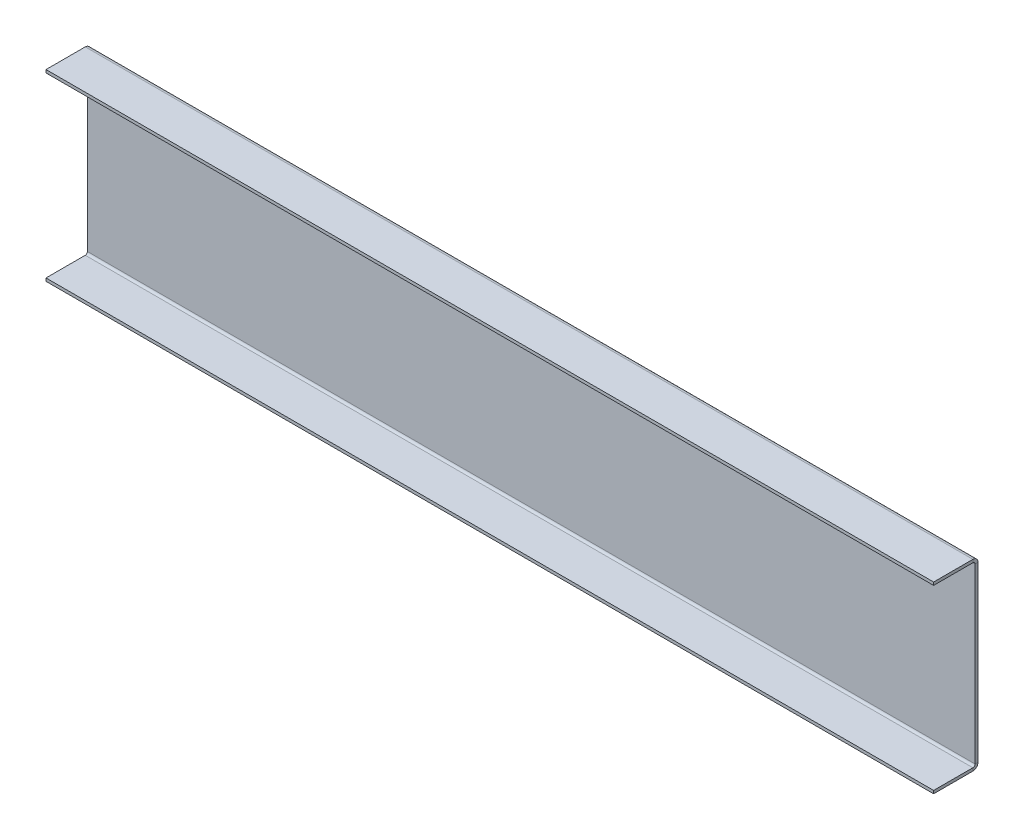
ISO-10303-21;
HEADER;
FILE_DESCRIPTION(('STEP AP214'),'2;1');
FILE_NAME('part.step','',(''),(''),'','','');
FILE_SCHEMA(('AUTOMOTIVE_DESIGN { 1 0 10303 214 1 1 1 1 }'));
ENDSEC;
DATA;
#1=APPLICATION_CONTEXT('core data for automotive mechanical design processes');
#2=APPLICATION_PROTOCOL_DEFINITION('international standard','automotive_design',2000,#1);
#3=PRODUCT_CONTEXT('',#1,'mechanical');
#4=PRODUCT('Part','Part','',(#3));
#5=PRODUCT_RELATED_PRODUCT_CATEGORY('part','',(#4));
#6=PRODUCT_DEFINITION_FORMATION('','',#4);
#7=PRODUCT_DEFINITION_CONTEXT('part definition',#1,'design');
#8=PRODUCT_DEFINITION('design','',#6,#7);
#9=PRODUCT_DEFINITION_SHAPE('','',#8);
#10=(LENGTH_UNIT() NAMED_UNIT(*) SI_UNIT(.MILLI.,.METRE.));
#11=(NAMED_UNIT(*) PLANE_ANGLE_UNIT() SI_UNIT($,.RADIAN.));
#12=(NAMED_UNIT(*) SI_UNIT($,.STERADIAN.) SOLID_ANGLE_UNIT());
#13=UNCERTAINTY_MEASURE_WITH_UNIT(LENGTH_MEASURE(1.E-05),#10,'distance_accuracy_value','');
#14=(GEOMETRIC_REPRESENTATION_CONTEXT(3) GLOBAL_UNCERTAINTY_ASSIGNED_CONTEXT((#13)) GLOBAL_UNIT_ASSIGNED_CONTEXT((#10,
#11,#12)) REPRESENTATION_CONTEXT('',''));
#15=CARTESIAN_POINT('',(0.,0.,0.));
#16=DIRECTION('',(0.,0.,1.));
#17=DIRECTION('',(1.,0.,0.));
#18=AXIS2_PLACEMENT_3D('',#15,#16,#17);
#19=CARTESIAN_POINT('',(0.,0.,-1.));
#20=DIRECTION('',(0.,0.,1.));
#21=DIRECTION('',(1.,0.,0.));
#22=AXIS2_PLACEMENT_3D('',#19,#20,#21);
#23=PLANE('',#22);
#24=DIRECTION('',(1.,0.,0.));
#25=VECTOR('',#24,1.);
#26=CARTESIAN_POINT('',(150.,-29.2634,-1.));
#27=LINE('',#26,#25);
#28=CARTESIAN_POINT('',(150.,-29.2634,-1.));
#29=VERTEX_POINT('',#28);
#30=CARTESIAN_POINT('',(-150.,-29.2634,-1.));
#31=VERTEX_POINT('',#30);
#32=EDGE_CURVE('E138',#29,#31,#27,.F.);
#33=ORIENTED_EDGE('',*,*,#32,.T.);
#34=DIRECTION('',(0.,-1.,0.));
#35=VECTOR('',#34,1.);
#36=CARTESIAN_POINT('',(-150.,30.,-1.));
#37=LINE('',#36,#35);
#38=CARTESIAN_POINT('',(-150.,29.2634,-0.999999999999997));
#39=VERTEX_POINT('',#38);
#40=EDGE_CURVE('E11',#39,#31,#37,.T.);
#41=ORIENTED_EDGE('',*,*,#40,.F.);
#42=DIRECTION('',(-1.,0.,0.));
#43=VECTOR('',#42,1.);
#44=CARTESIAN_POINT('',(-150.,29.2634,-0.999999999999997));
#45=LINE('',#44,#43);
#46=CARTESIAN_POINT('',(150.,29.2634,-1.));
#47=VERTEX_POINT('',#46);
#48=EDGE_CURVE('E227',#39,#47,#45,.F.);
#49=ORIENTED_EDGE('',*,*,#48,.T.);
#50=DIRECTION('',(0.,1.,0.));
#51=VECTOR('',#50,1.);
#52=CARTESIAN_POINT('',(150.,30.,-1.));
#53=LINE('',#52,#51);
#54=EDGE_CURVE('E48',#29,#47,#53,.T.);
#55=ORIENTED_EDGE('',*,*,#54,.F.);
#56=EDGE_LOOP('',(#33,#41,#49,#55));
#57=FACE_BOUND('',#56,.T.);
#58=ADVANCED_FACE('F39',(#57),#23,.F.);
#59=CARTESIAN_POINT('',(0.,0.,0.));
#60=DIRECTION('',(0.,0.,1.));
#61=DIRECTION('',(1.,0.,0.));
#62=AXIS2_PLACEMENT_3D('',#59,#60,#61);
#63=PLANE('',#62);
#64=DIRECTION('',(0.,-1.,0.));
#65=VECTOR('',#64,1.);
#66=CARTESIAN_POINT('',(-150.,30.,0.));
#67=LINE('',#66,#65);
#68=CARTESIAN_POINT('',(-150.,29.2634,0.));
#69=VERTEX_POINT('',#68);
#70=CARTESIAN_POINT('',(-150.,-29.2634,0.));
#71=VERTEX_POINT('',#70);
#72=EDGE_CURVE('E43',#69,#71,#67,.T.);
#73=ORIENTED_EDGE('',*,*,#72,.T.);
#74=DIRECTION('',(1.,0.,0.));
#75=VECTOR('',#74,1.);
#76=CARTESIAN_POINT('',(150.,-29.2634,0.));
#77=LINE('',#76,#75);
#78=CARTESIAN_POINT('',(150.,-29.2634,0.));
#79=VERTEX_POINT('',#78);
#80=EDGE_CURVE('E188',#79,#71,#77,.F.);
#81=ORIENTED_EDGE('',*,*,#80,.F.);
#82=DIRECTION('',(0.,1.,0.));
#83=VECTOR('',#82,1.);
#84=CARTESIAN_POINT('',(150.,30.,0.));
#85=LINE('',#84,#83);
#86=CARTESIAN_POINT('',(150.,29.2634,0.));
#87=VERTEX_POINT('',#86);
#88=EDGE_CURVE('E245',#79,#87,#85,.T.);
#89=ORIENTED_EDGE('',*,*,#88,.T.);
#90=DIRECTION('',(-1.,0.,0.));
#91=VECTOR('',#90,1.);
#92=CARTESIAN_POINT('',(-150.,29.2634,0.));
#93=LINE('',#92,#91);
#94=EDGE_CURVE('E56',#69,#87,#93,.F.);
#95=ORIENTED_EDGE('',*,*,#94,.F.);
#96=EDGE_LOOP('',(#73,#81,#89,#95));
#97=FACE_BOUND('',#96,.T.);
#98=ADVANCED_FACE('F249',(#97),#63,.T.);
#99=CARTESIAN_POINT('',(150.,30.,-1.));
#100=DIRECTION('',(1.,0.,0.));
#101=DIRECTION('',(0.,0.,-1.));
#102=AXIS2_PLACEMENT_3D('',#99,#100,#101);
#103=PLANE('',#102);
#104=ORIENTED_EDGE('',*,*,#88,.F.);
#105=DIRECTION('',(0.,0.,-1.));
#106=VECTOR('',#105,1.);
#107=CARTESIAN_POINT('',(150.,-29.2634,0.));
#108=LINE('',#107,#106);
#109=EDGE_CURVE('E184',#79,#29,#108,.T.);
#110=ORIENTED_EDGE('',*,*,#109,.T.);
#111=ORIENTED_EDGE('',*,*,#54,.T.);
#112=DIRECTION('',(0.,0.,-1.));
#113=VECTOR('',#112,1.);
#114=CARTESIAN_POINT('',(150.,29.2634,0.));
#115=LINE('',#114,#113);
#116=EDGE_CURVE('E242',#87,#47,#115,.T.);
#117=ORIENTED_EDGE('',*,*,#116,.F.);
#118=EDGE_LOOP('',(#104,#110,#111,#117));
#119=FACE_BOUND('',#118,.T.);
#120=ADVANCED_FACE('F41',(#119),#103,.T.);
#121=CARTESIAN_POINT('',(-150.,30.,-1.));
#122=DIRECTION('',(-1.,0.,0.));
#123=DIRECTION('',(0.,0.,1.));
#124=AXIS2_PLACEMENT_3D('',#121,#122,#123);
#125=PLANE('',#124);
#126=DIRECTION('',(0.,0.,-1.));
#127=VECTOR('',#126,1.);
#128=CARTESIAN_POINT('',(-150.,-29.2634,0.));
#129=LINE('',#128,#127);
#130=EDGE_CURVE('E192',#71,#31,#129,.T.);
#131=ORIENTED_EDGE('',*,*,#130,.F.);
#132=ORIENTED_EDGE('',*,*,#72,.F.);
#133=DIRECTION('',(0.,0.,-1.));
#134=VECTOR('',#133,1.);
#135=CARTESIAN_POINT('',(-150.,29.2634,0.));
#136=LINE('',#135,#134);
#137=EDGE_CURVE('E233',#69,#39,#136,.T.);
#138=ORIENTED_EDGE('',*,*,#137,.T.);
#139=ORIENTED_EDGE('',*,*,#40,.T.);
#140=EDGE_LOOP('',(#131,#132,#138,#139));
#141=FACE_BOUND('',#140,.T.);
#142=ADVANCED_FACE('F288',(#141),#125,.T.);
#143=CARTESIAN_POINT('',(150.,29.2634,0.736600000000003));
#144=DIRECTION('',(1.,0.,0.));
#145=DIRECTION('',(0.,0.,-1.));
#146=AXIS2_PLACEMENT_3D('',#143,#144,#145);
#147=PLANE('',#146);
#148=DIRECTION('',(0.,1.,0.));
#149=VECTOR('',#148,1.);
#150=CARTESIAN_POINT('',(150.,30.,0.736599999999997));
#151=LINE('',#150,#149);
#152=CARTESIAN_POINT('',(150.,30.,0.7366));
#153=VERTEX_POINT('',#152);
#154=CARTESIAN_POINT('',(150.,31.,0.736599999999997));
#155=VERTEX_POINT('',#154);
#156=EDGE_CURVE('E195',#153,#155,#151,.T.);
#157=ORIENTED_EDGE('',*,*,#156,.F.);
#158=CARTESIAN_POINT('',(150.,29.2634,0.736600000000003));
#159=DIRECTION('',(-1.,0.,0.));
#160=DIRECTION('',(0.,0.,1.));
#161=AXIS2_PLACEMENT_3D('',#158,#159,#160);
#162=CIRCLE('',#161,0.7366);
#163=EDGE_CURVE('E236',#87,#153,#162,.F.);
#164=ORIENTED_EDGE('',*,*,#163,.F.);
#165=ORIENTED_EDGE('',*,*,#116,.T.);
#166=CARTESIAN_POINT('',(150.,29.2634,0.736600000000003));
#167=DIRECTION('',(-1.,0.,0.));
#168=DIRECTION('',(0.,0.,1.));
#169=AXIS2_PLACEMENT_3D('',#166,#167,#168);
#170=CIRCLE('',#169,1.7366);
#171=EDGE_CURVE('E229',#47,#155,#170,.F.);
#172=ORIENTED_EDGE('',*,*,#171,.T.);
#173=EDGE_LOOP('',(#157,#164,#165,#172));
#174=FACE_BOUND('',#173,.T.);
#175=ADVANCED_FACE('F290',(#174),#147,.T.);
#176=CARTESIAN_POINT('',(-150.,29.2634,0.736600000000003));
#177=DIRECTION('',(1.,0.,0.));
#178=DIRECTION('',(0.,0.,-1.));
#179=AXIS2_PLACEMENT_3D('',#176,#177,#178);
#180=PLANE('',#179);
#181=CARTESIAN_POINT('',(-150.,29.2634,0.736600000000003));
#182=DIRECTION('',(-1.,0.,0.));
#183=DIRECTION('',(0.,0.,1.));
#184=AXIS2_PLACEMENT_3D('',#181,#182,#183);
#185=CIRCLE('',#184,0.7366);
#186=CARTESIAN_POINT('',(-150.,30.,0.7366));
#187=VERTEX_POINT('',#186);
#188=EDGE_CURVE('E226',#187,#69,#185,.T.);
#189=ORIENTED_EDGE('',*,*,#188,.F.);
#190=DIRECTION('',(0.,1.,0.));
#191=VECTOR('',#190,1.);
#192=CARTESIAN_POINT('',(-150.,30.,0.736600000000004));
#193=LINE('',#192,#191);
#194=CARTESIAN_POINT('',(-150.,31.,0.7366));
#195=VERTEX_POINT('',#194);
#196=EDGE_CURVE('E199',#187,#195,#193,.T.);
#197=ORIENTED_EDGE('',*,*,#196,.T.);
#198=CARTESIAN_POINT('',(-150.,29.2634,0.736600000000003));
#199=DIRECTION('',(-1.,0.,0.));
#200=DIRECTION('',(0.,0.,1.));
#201=AXIS2_PLACEMENT_3D('',#198,#199,#200);
#202=CIRCLE('',#201,1.7366);
#203=EDGE_CURVE('E230',#195,#39,#202,.T.);
#204=ORIENTED_EDGE('',*,*,#203,.T.);
#205=ORIENTED_EDGE('',*,*,#137,.F.);
#206=EDGE_LOOP('',(#189,#197,#204,#205));
#207=FACE_BOUND('',#206,.T.);
#208=ADVANCED_FACE('F286',(#207),#180,.F.);
#209=CARTESIAN_POINT('',(-150.,29.2634,0.736600000000003));
#210=DIRECTION('',(-1.,0.,0.));
#211=DIRECTION('',(0.,1.,0.));
#212=AXIS2_PLACEMENT_3D('',#209,#210,#211);
#213=CYLINDRICAL_SURFACE('',#212,1.7366);
#214=ORIENTED_EDGE('',*,*,#48,.F.);
#215=ORIENTED_EDGE('',*,*,#203,.F.);
#216=DIRECTION('',(1.,0.,0.));
#217=VECTOR('',#216,1.);
#218=CARTESIAN_POINT('',(0.,31.,0.736599999999997));
#219=LINE('',#218,#217);
#220=EDGE_CURVE('E202',#195,#155,#219,.T.);
#221=ORIENTED_EDGE('',*,*,#220,.T.);
#222=ORIENTED_EDGE('',*,*,#171,.F.);
#223=EDGE_LOOP('',(#214,#215,#221,#222));
#224=FACE_BOUND('',#223,.T.);
#225=ADVANCED_FACE('F335',(#224),#213,.T.);
#226=CARTESIAN_POINT('',(-150.,29.2634,0.736600000000003));
#227=DIRECTION('',(-1.,0.,0.));
#228=DIRECTION('',(0.,1.,0.));
#229=AXIS2_PLACEMENT_3D('',#226,#227,#228);
#230=CYLINDRICAL_SURFACE('',#229,0.7366);
#231=ORIENTED_EDGE('',*,*,#94,.T.);
#232=ORIENTED_EDGE('',*,*,#163,.T.);
#233=DIRECTION('',(-1.,0.,0.));
#234=VECTOR('',#233,1.);
#235=CARTESIAN_POINT('',(150.,30.,0.736599999999997));
#236=LINE('',#235,#234);
#237=EDGE_CURVE('E197',#153,#187,#236,.T.);
#238=ORIENTED_EDGE('',*,*,#237,.T.);
#239=ORIENTED_EDGE('',*,*,#188,.T.);
#240=EDGE_LOOP('',(#231,#232,#238,#239));
#241=FACE_BOUND('',#240,.T.);
#242=ADVANCED_FACE('F300',(#241),#230,.F.);
#243=CARTESIAN_POINT('',(150.,31.,0.));
#244=DIRECTION('',(-1.,0.,0.));
#245=DIRECTION('',(0.,0.,1.));
#246=AXIS2_PLACEMENT_3D('',#243,#244,#245);
#247=PLANE('',#246);
#248=ORIENTED_EDGE('',*,*,#156,.T.);
#249=DIRECTION('',(0.,0.,-1.));
#250=VECTOR('',#249,1.);
#251=CARTESIAN_POINT('',(150.,31.,0.));
#252=LINE('',#251,#250);
#253=CARTESIAN_POINT('',(150.,31.,14.));
#254=VERTEX_POINT('',#253);
#255=EDGE_CURVE('E207',#254,#155,#252,.T.);
#256=ORIENTED_EDGE('',*,*,#255,.F.);
#257=DIRECTION('',(0.,-1.,0.));
#258=VECTOR('',#257,1.);
#259=CARTESIAN_POINT('',(150.,31.,14.));
#260=LINE('',#259,#258);
#261=CARTESIAN_POINT('',(150.,30.,14.));
#262=VERTEX_POINT('',#261);
#263=EDGE_CURVE('E215',#254,#262,#260,.T.);
#264=ORIENTED_EDGE('',*,*,#263,.T.);
#265=DIRECTION('',(0.,0.,-1.));
#266=VECTOR('',#265,1.);
#267=CARTESIAN_POINT('',(150.,30.,0.));
#268=LINE('',#267,#266);
#269=EDGE_CURVE('E206',#262,#153,#268,.T.);
#270=ORIENTED_EDGE('',*,*,#269,.T.);
#271=EDGE_LOOP('',(#248,#256,#264,#270));
#272=FACE_BOUND('',#271,.T.);
#273=ADVANCED_FACE('F305',(#272),#247,.F.);
#274=CARTESIAN_POINT('',(-150.,31.,14.));
#275=DIRECTION('',(1.,0.,0.));
#276=DIRECTION('',(0.,0.,-1.));
#277=AXIS2_PLACEMENT_3D('',#274,#275,#276);
#278=PLANE('',#277);
#279=ORIENTED_EDGE('',*,*,#196,.F.);
#280=DIRECTION('',(0.,0.,1.));
#281=VECTOR('',#280,1.);
#282=CARTESIAN_POINT('',(-150.,30.,14.));
#283=LINE('',#282,#281);
#284=CARTESIAN_POINT('',(-150.,30.,14.));
#285=VERTEX_POINT('',#284);
#286=EDGE_CURVE('E218',#187,#285,#283,.T.);
#287=ORIENTED_EDGE('',*,*,#286,.T.);
#288=DIRECTION('',(0.,-1.,0.));
#289=VECTOR('',#288,1.);
#290=CARTESIAN_POINT('',(-150.,31.,14.));
#291=LINE('',#290,#289);
#292=CARTESIAN_POINT('',(-150.,31.,14.));
#293=VERTEX_POINT('',#292);
#294=EDGE_CURVE('E223',#293,#285,#291,.T.);
#295=ORIENTED_EDGE('',*,*,#294,.F.);
#296=DIRECTION('',(0.,0.,1.));
#297=VECTOR('',#296,1.);
#298=CARTESIAN_POINT('',(-150.,31.,14.));
#299=LINE('',#298,#297);
#300=EDGE_CURVE('E210',#195,#293,#299,.T.);
#301=ORIENTED_EDGE('',*,*,#300,.F.);
#302=EDGE_LOOP('',(#279,#287,#295,#301));
#303=FACE_BOUND('',#302,.T.);
#304=ADVANCED_FACE('F323',(#303),#278,.F.);
#305=CARTESIAN_POINT('',(0.,31.,-1.07574889897452E-13));
#306=DIRECTION('',(0.,-1.,0.));
#307=DIRECTION('',(0.,0.,-1.));
#308=AXIS2_PLACEMENT_3D('',#305,#306,#307);
#309=PLANE('',#308);
#310=ORIENTED_EDGE('',*,*,#220,.F.);
#311=ORIENTED_EDGE('',*,*,#300,.T.);
#312=DIRECTION('',(1.,0.,0.));
#313=VECTOR('',#312,1.);
#314=CARTESIAN_POINT('',(150.,31.,14.));
#315=LINE('',#314,#313);
#316=EDGE_CURVE('E213',#293,#254,#315,.T.);
#317=ORIENTED_EDGE('',*,*,#316,.T.);
#318=ORIENTED_EDGE('',*,*,#255,.T.);
#319=EDGE_LOOP('',(#310,#311,#317,#318));
#320=FACE_BOUND('',#319,.T.);
#321=ADVANCED_FACE('F309',(#320),#309,.F.);
#322=CARTESIAN_POINT('',(0.,30.,-1.04083408558608E-13));
#323=DIRECTION('',(0.,-1.,0.));
#324=DIRECTION('',(0.,0.,-1.));
#325=AXIS2_PLACEMENT_3D('',#322,#323,#324);
#326=PLANE('',#325);
#327=ORIENTED_EDGE('',*,*,#286,.F.);
#328=ORIENTED_EDGE('',*,*,#237,.F.);
#329=ORIENTED_EDGE('',*,*,#269,.F.);
#330=DIRECTION('',(1.,0.,0.));
#331=VECTOR('',#330,1.);
#332=CARTESIAN_POINT('',(150.,30.,14.));
#333=LINE('',#332,#331);
#334=EDGE_CURVE('E211',#285,#262,#333,.T.);
#335=ORIENTED_EDGE('',*,*,#334,.F.);
#336=EDGE_LOOP('',(#327,#328,#329,#335));
#337=FACE_BOUND('',#336,.T.);
#338=ADVANCED_FACE('F319',(#337),#326,.T.);
#339=CARTESIAN_POINT('',(150.,31.,14.));
#340=DIRECTION('',(0.,0.,-1.));
#341=DIRECTION('',(0.,1.,0.));
#342=AXIS2_PLACEMENT_3D('',#339,#340,#341);
#343=PLANE('',#342);
#344=ORIENTED_EDGE('',*,*,#334,.T.);
#345=ORIENTED_EDGE('',*,*,#263,.F.);
#346=ORIENTED_EDGE('',*,*,#316,.F.);
#347=ORIENTED_EDGE('',*,*,#294,.T.);
#348=EDGE_LOOP('',(#344,#345,#346,#347));
#349=FACE_BOUND('',#348,.T.);
#350=ADVANCED_FACE('F315',(#349),#343,.F.);
#351=CARTESIAN_POINT('',(-150.,-29.2634,0.736599999999998));
#352=DIRECTION('',(-1.,0.,0.));
#353=DIRECTION('',(0.,0.,1.));
#354=AXIS2_PLACEMENT_3D('',#351,#352,#353);
#355=PLANE('',#354);
#356=DIRECTION('',(0.,-1.,0.));
#357=VECTOR('',#356,1.);
#358=CARTESIAN_POINT('',(-150.,-30.,0.736599999999997));
#359=LINE('',#358,#357);
#360=CARTESIAN_POINT('',(-150.,-30.,0.736599999999995));
#361=VERTEX_POINT('',#360);
#362=CARTESIAN_POINT('',(-150.,-31.,0.736599999999992));
#363=VERTEX_POINT('',#362);
#364=EDGE_CURVE('E259',#361,#363,#359,.T.);
#365=ORIENTED_EDGE('',*,*,#364,.F.);
#366=CARTESIAN_POINT('',(-150.,-29.2634,0.736599999999998));
#367=DIRECTION('',(1.,0.,0.));
#368=DIRECTION('',(0.,0.,-1.));
#369=AXIS2_PLACEMENT_3D('',#366,#367,#368);
#370=CIRCLE('',#369,0.7366);
#371=EDGE_CURVE('E141',#71,#361,#370,.F.);
#372=ORIENTED_EDGE('',*,*,#371,.F.);
#373=ORIENTED_EDGE('',*,*,#130,.T.);
#374=CARTESIAN_POINT('',(-150.,-29.2634,0.736599999999998));
#375=DIRECTION('',(1.,0.,0.));
#376=DIRECTION('',(0.,0.,-1.));
#377=AXIS2_PLACEMENT_3D('',#374,#375,#376);
#378=CIRCLE('',#377,1.7366);
#379=EDGE_CURVE('E183',#31,#363,#378,.F.);
#380=ORIENTED_EDGE('',*,*,#379,.T.);
#381=EDGE_LOOP('',(#365,#372,#373,#380));
#382=FACE_BOUND('',#381,.T.);
#383=ADVANCED_FACE('F257',(#382),#355,.T.);
#384=CARTESIAN_POINT('',(150.,-29.2634,0.736599999999998));
#385=DIRECTION('',(-1.,0.,0.));
#386=DIRECTION('',(0.,0.,1.));
#387=AXIS2_PLACEMENT_3D('',#384,#385,#386);
#388=PLANE('',#387);
#389=CARTESIAN_POINT('',(150.,-29.2634,0.736599999999998));
#390=DIRECTION('',(1.,0.,0.));
#391=DIRECTION('',(0.,0.,-1.));
#392=AXIS2_PLACEMENT_3D('',#389,#390,#391);
#393=CIRCLE('',#392,0.7366);
#394=CARTESIAN_POINT('',(150.,-30.,0.736599999999995));
#395=VERTEX_POINT('',#394);
#396=EDGE_CURVE('E148',#395,#79,#393,.T.);
#397=ORIENTED_EDGE('',*,*,#396,.F.);
#398=DIRECTION('',(0.,-1.,0.));
#399=VECTOR('',#398,1.);
#400=CARTESIAN_POINT('',(150.,-30.,0.736599999999993));
#401=LINE('',#400,#399);
#402=CARTESIAN_POINT('',(150.,-31.,0.73659999999999));
#403=VERTEX_POINT('',#402);
#404=EDGE_CURVE('E145',#395,#403,#401,.T.);
#405=ORIENTED_EDGE('',*,*,#404,.T.);
#406=CARTESIAN_POINT('',(150.,-29.2634,0.736599999999998));
#407=DIRECTION('',(1.,0.,0.));
#408=DIRECTION('',(0.,0.,-1.));
#409=AXIS2_PLACEMENT_3D('',#406,#407,#408);
#410=CIRCLE('',#409,1.7366);
#411=EDGE_CURVE('E131',#403,#29,#410,.T.);
#412=ORIENTED_EDGE('',*,*,#411,.T.);
#413=ORIENTED_EDGE('',*,*,#109,.F.);
#414=EDGE_LOOP('',(#397,#405,#412,#413));
#415=FACE_BOUND('',#414,.T.);
#416=ADVANCED_FACE('F146',(#415),#388,.F.);
#417=CARTESIAN_POINT('',(150.,-29.2634,0.736599999999998));
#418=DIRECTION('',(1.,0.,0.));
#419=DIRECTION('',(0.,-1.,0.));
#420=AXIS2_PLACEMENT_3D('',#417,#418,#419);
#421=CYLINDRICAL_SURFACE('',#420,1.7366);
#422=ORIENTED_EDGE('',*,*,#32,.F.);
#423=ORIENTED_EDGE('',*,*,#411,.F.);
#424=DIRECTION('',(-1.,0.,0.));
#425=VECTOR('',#424,1.);
#426=CARTESIAN_POINT('',(0.,-31.,0.736599999999992));
#427=LINE('',#426,#425);
#428=EDGE_CURVE('E136',#403,#363,#427,.T.);
#429=ORIENTED_EDGE('',*,*,#428,.T.);
#430=ORIENTED_EDGE('',*,*,#379,.F.);
#431=EDGE_LOOP('',(#422,#423,#429,#430));
#432=FACE_BOUND('',#431,.T.);
#433=ADVANCED_FACE('F133',(#432),#421,.T.);
#434=CARTESIAN_POINT('',(150.,-29.2634,0.736599999999998));
#435=DIRECTION('',(1.,0.,0.));
#436=DIRECTION('',(0.,-1.,0.));
#437=AXIS2_PLACEMENT_3D('',#434,#435,#436);
#438=CYLINDRICAL_SURFACE('',#437,0.7366);
#439=ORIENTED_EDGE('',*,*,#80,.T.);
#440=ORIENTED_EDGE('',*,*,#371,.T.);
#441=DIRECTION('',(1.,0.,0.));
#442=VECTOR('',#441,1.);
#443=CARTESIAN_POINT('',(-150.,-30.,0.736599999999997));
#444=LINE('',#443,#442);
#445=EDGE_CURVE('E152',#361,#395,#444,.T.);
#446=ORIENTED_EDGE('',*,*,#445,.T.);
#447=ORIENTED_EDGE('',*,*,#396,.T.);
#448=EDGE_LOOP('',(#439,#440,#446,#447));
#449=FACE_BOUND('',#448,.T.);
#450=ADVANCED_FACE('F254',(#449),#438,.F.);
#451=CARTESIAN_POINT('',(-150.,-31.,0.));
#452=DIRECTION('',(1.,0.,0.));
#453=DIRECTION('',(0.,0.,-1.));
#454=AXIS2_PLACEMENT_3D('',#451,#452,#453);
#455=PLANE('',#454);
#456=ORIENTED_EDGE('',*,*,#364,.T.);
#457=DIRECTION('',(0.,0.,-1.));
#458=VECTOR('',#457,1.);
#459=CARTESIAN_POINT('',(-150.,-31.,0.));
#460=LINE('',#459,#458);
#461=CARTESIAN_POINT('',(-150.,-31.0000000000001,14.));
#462=VERTEX_POINT('',#461);
#463=EDGE_CURVE('E160',#462,#363,#460,.T.);
#464=ORIENTED_EDGE('',*,*,#463,.F.);
#465=DIRECTION('',(0.,1.,0.));
#466=VECTOR('',#465,1.);
#467=CARTESIAN_POINT('',(-150.,-31.0000000000001,14.));
#468=LINE('',#467,#466);
#469=CARTESIAN_POINT('',(-150.,-30.,14.));
#470=VERTEX_POINT('',#469);
#471=EDGE_CURVE('E169',#462,#470,#468,.T.);
#472=ORIENTED_EDGE('',*,*,#471,.T.);
#473=DIRECTION('',(0.,0.,-1.));
#474=VECTOR('',#473,1.);
#475=CARTESIAN_POINT('',(-150.,-30.,0.));
#476=LINE('',#475,#474);
#477=EDGE_CURVE('E161',#470,#361,#476,.T.);
#478=ORIENTED_EDGE('',*,*,#477,.T.);
#479=EDGE_LOOP('',(#456,#464,#472,#478));
#480=FACE_BOUND('',#479,.T.);
#481=ADVANCED_FACE('F267',(#480),#455,.F.);
#482=CARTESIAN_POINT('',(150.,-31.0000000000001,14.));
#483=DIRECTION('',(-1.,0.,0.));
#484=DIRECTION('',(0.,0.,1.));
#485=AXIS2_PLACEMENT_3D('',#482,#483,#484);
#486=PLANE('',#485);
#487=ORIENTED_EDGE('',*,*,#404,.F.);
#488=DIRECTION('',(0.,0.,1.));
#489=VECTOR('',#488,1.);
#490=CARTESIAN_POINT('',(150.,-30.,14.));
#491=LINE('',#490,#489);
#492=CARTESIAN_POINT('',(150.,-30.,14.));
#493=VERTEX_POINT('',#492);
#494=EDGE_CURVE('E176',#395,#493,#491,.T.);
#495=ORIENTED_EDGE('',*,*,#494,.T.);
#496=DIRECTION('',(0.,1.,0.));
#497=VECTOR('',#496,1.);
#498=CARTESIAN_POINT('',(150.,-31.0000000000001,14.));
#499=LINE('',#498,#497);
#500=CARTESIAN_POINT('',(150.,-31.0000000000001,14.));
#501=VERTEX_POINT('',#500);
#502=EDGE_CURVE('E165',#501,#493,#499,.T.);
#503=ORIENTED_EDGE('',*,*,#502,.F.);
#504=DIRECTION('',(0.,0.,1.));
#505=VECTOR('',#504,1.);
#506=CARTESIAN_POINT('',(150.,-31.0000000000001,14.));
#507=LINE('',#506,#505);
#508=EDGE_CURVE('E157',#403,#501,#507,.T.);
#509=ORIENTED_EDGE('',*,*,#508,.F.);
#510=EDGE_LOOP('',(#487,#495,#503,#509));
#511=FACE_BOUND('',#510,.T.);
#512=ADVANCED_FACE('F163',(#511),#486,.F.);
#513=CARTESIAN_POINT('',(0.,-31.,-1.07574889897452E-13));
#514=DIRECTION('',(0.,1.,0.));
#515=DIRECTION('',(0.,0.,1.));
#516=AXIS2_PLACEMENT_3D('',#513,#514,#515);
#517=PLANE('',#516);
#518=ORIENTED_EDGE('',*,*,#428,.F.);
#519=ORIENTED_EDGE('',*,*,#508,.T.);
#520=DIRECTION('',(-1.,0.,0.));
#521=VECTOR('',#520,1.);
#522=CARTESIAN_POINT('',(-150.,-31.0000000000001,14.));
#523=LINE('',#522,#521);
#524=EDGE_CURVE('E167',#501,#462,#523,.T.);
#525=ORIENTED_EDGE('',*,*,#524,.T.);
#526=ORIENTED_EDGE('',*,*,#463,.T.);
#527=EDGE_LOOP('',(#518,#519,#525,#526));
#528=FACE_BOUND('',#527,.T.);
#529=ADVANCED_FACE('F156',(#528),#517,.F.);
#530=CARTESIAN_POINT('',(0.,-30.,-1.04083408558608E-13));
#531=DIRECTION('',(0.,1.,0.));
#532=DIRECTION('',(0.,0.,1.));
#533=AXIS2_PLACEMENT_3D('',#530,#531,#532);
#534=PLANE('',#533);
#535=ORIENTED_EDGE('',*,*,#494,.F.);
#536=ORIENTED_EDGE('',*,*,#445,.F.);
#537=ORIENTED_EDGE('',*,*,#477,.F.);
#538=DIRECTION('',(-1.,0.,0.));
#539=VECTOR('',#538,1.);
#540=CARTESIAN_POINT('',(-150.,-30.,14.));
#541=LINE('',#540,#539);
#542=EDGE_CURVE('E171',#493,#470,#541,.T.);
#543=ORIENTED_EDGE('',*,*,#542,.F.);
#544=EDGE_LOOP('',(#535,#536,#537,#543));
#545=FACE_BOUND('',#544,.T.);
#546=ADVANCED_FACE('F265',(#545),#534,.T.);
#547=CARTESIAN_POINT('',(-150.,-31.0000000000001,14.));
#548=DIRECTION('',(0.,0.,-1.));
#549=DIRECTION('',(0.,1.,0.));
#550=AXIS2_PLACEMENT_3D('',#547,#548,#549);
#551=PLANE('',#550);
#552=ORIENTED_EDGE('',*,*,#542,.T.);
#553=ORIENTED_EDGE('',*,*,#471,.F.);
#554=ORIENTED_EDGE('',*,*,#524,.F.);
#555=ORIENTED_EDGE('',*,*,#502,.T.);
#556=EDGE_LOOP('',(#552,#553,#554,#555));
#557=FACE_BOUND('',#556,.T.);
#558=ADVANCED_FACE('F270',(#557),#551,.F.);
#559=CLOSED_SHELL('',(#58,#98,#120,#142,#175,#208,#225,#242,#273,#304,#321,#338,#350,#383,#416,
#433,#450,#481,#512,#529,#546,#558));
#560=MANIFOLD_SOLID_BREP('B2',#559);
#561=ADVANCED_BREP_SHAPE_REPRESENTATION('',(#18,#560),#14);
#562=SHAPE_DEFINITION_REPRESENTATION(#9,#561);
ENDSEC;
END-ISO-10303-21;
